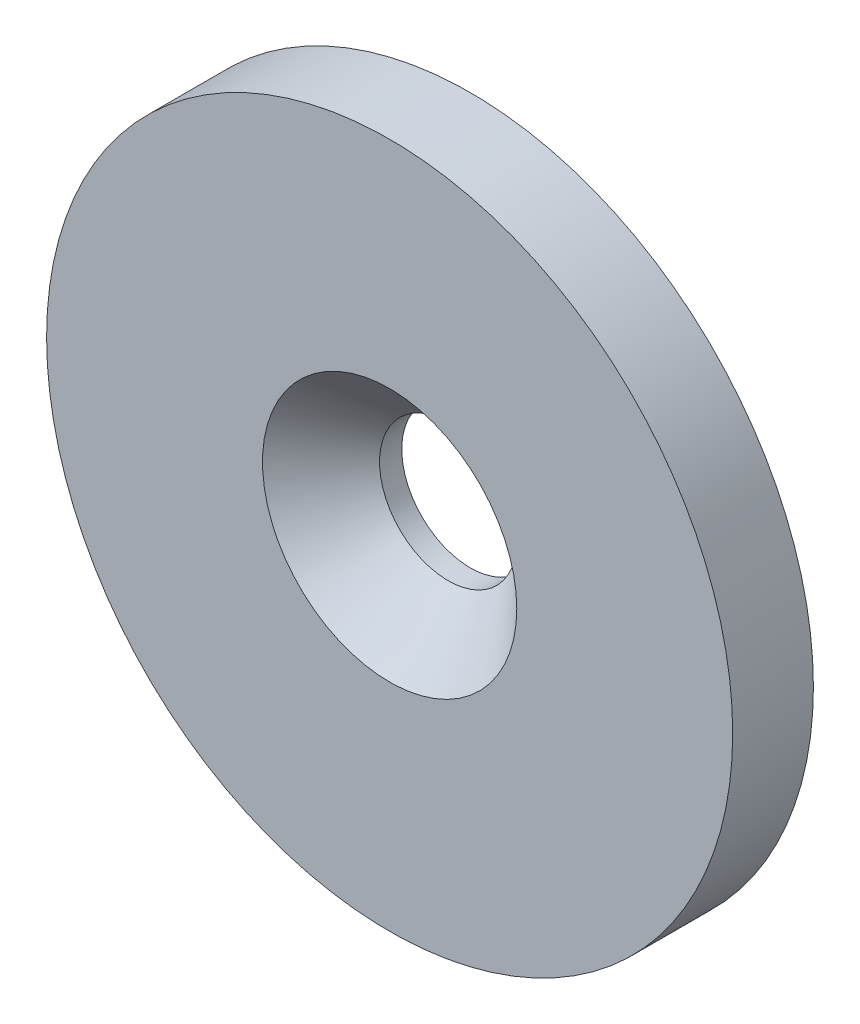
ISO-10303-21;
HEADER;
FILE_DESCRIPTION(('STEP AP214'),'2;1');
FILE_NAME('part.step','',(''),(''),'','','');
FILE_SCHEMA(('AUTOMOTIVE_DESIGN { 1 0 10303 214 1 1 1 1 }'));
ENDSEC;
DATA;
#1=APPLICATION_CONTEXT('core data for automotive mechanical design processes');
#2=APPLICATION_PROTOCOL_DEFINITION('international standard','automotive_design',2000,#1);
#3=PRODUCT_CONTEXT('',#1,'mechanical');
#4=PRODUCT('Part','Part','',(#3));
#5=PRODUCT_RELATED_PRODUCT_CATEGORY('part','',(#4));
#6=PRODUCT_DEFINITION_FORMATION('','',#4);
#7=PRODUCT_DEFINITION_CONTEXT('part definition',#1,'design');
#8=PRODUCT_DEFINITION('design','',#6,#7);
#9=PRODUCT_DEFINITION_SHAPE('','',#8);
#10=(LENGTH_UNIT() NAMED_UNIT(*) SI_UNIT(.MILLI.,.METRE.));
#11=(NAMED_UNIT(*) PLANE_ANGLE_UNIT() SI_UNIT($,.RADIAN.));
#12=(NAMED_UNIT(*) SI_UNIT($,.STERADIAN.) SOLID_ANGLE_UNIT());
#13=UNCERTAINTY_MEASURE_WITH_UNIT(LENGTH_MEASURE(1.E-05),#10,'distance_accuracy_value','');
#14=(GEOMETRIC_REPRESENTATION_CONTEXT(3) GLOBAL_UNCERTAINTY_ASSIGNED_CONTEXT((#13)) GLOBAL_UNIT_ASSIGNED_CONTEXT((#10,
#11,#12)) REPRESENTATION_CONTEXT('',''));
#15=CARTESIAN_POINT('',(0.,0.,0.));
#16=DIRECTION('',(0.,0.,1.));
#17=DIRECTION('',(1.,0.,0.));
#18=AXIS2_PLACEMENT_3D('',#15,#16,#17);
#19=CARTESIAN_POINT('',(0.,0.,-2.));
#20=DIRECTION('',(0.,0.,1.));
#21=DIRECTION('',(1.,0.,0.));
#22=AXIS2_PLACEMENT_3D('',#19,#20,#21);
#23=CYLINDRICAL_SURFACE('',#22,8.5);
#24=CARTESIAN_POINT('',(0.,0.,-2.));
#25=DIRECTION('',(0.,0.,1.));
#26=DIRECTION('',(1.,0.,0.));
#27=AXIS2_PLACEMENT_3D('',#24,#25,#26);
#28=CIRCLE('',#27,8.5);
#29=CARTESIAN_POINT('',(8.5,0.,-2.));
#30=VERTEX_POINT('',#29);
#31=EDGE_CURVE('E10',#30,#30,#28,.T.);
#32=ORIENTED_EDGE('',*,*,#31,.T.);
#33=EDGE_LOOP('',(#32));
#34=FACE_BOUND('',#33,.T.);
#35=CARTESIAN_POINT('',(0.,0.,0.));
#36=DIRECTION('',(0.,0.,1.));
#37=DIRECTION('',(1.,0.,0.));
#38=AXIS2_PLACEMENT_3D('',#35,#36,#37);
#39=CIRCLE('',#38,8.5);
#40=CARTESIAN_POINT('',(8.5,0.,0.));
#41=VERTEX_POINT('',#40);
#42=EDGE_CURVE('E38',#41,#41,#39,.T.);
#43=ORIENTED_EDGE('',*,*,#42,.F.);
#44=EDGE_LOOP('',(#43));
#45=FACE_BOUND('',#44,.T.);
#46=ADVANCED_FACE('F35',(#34,#45),#23,.T.);
#47=CARTESIAN_POINT('',(0.,0.,-2.));
#48=DIRECTION('',(0.,0.,1.));
#49=DIRECTION('',(1.,0.,0.));
#50=AXIS2_PLACEMENT_3D('',#47,#48,#49);
#51=PLANE('',#50);
#52=CARTESIAN_POINT('',(0.,0.,-2.));
#53=DIRECTION('',(0.,0.,1.));
#54=DIRECTION('',(1.,0.,0.));
#55=AXIS2_PLACEMENT_3D('',#52,#53,#54);
#56=CIRCLE('',#55,1.7);
#57=CARTESIAN_POINT('',(1.7,0.,-2.));
#58=VERTEX_POINT('',#57);
#59=EDGE_CURVE('E45',#58,#58,#56,.T.);
#60=ORIENTED_EDGE('',*,*,#59,.T.);
#61=EDGE_LOOP('',(#60));
#62=FACE_BOUND('',#61,.T.);
#63=ORIENTED_EDGE('',*,*,#31,.F.);
#64=EDGE_LOOP('',(#63));
#65=FACE_BOUND('',#64,.T.);
#66=ADVANCED_FACE('F62',(#62,#65),#51,.F.);
#67=CARTESIAN_POINT('',(0.,0.,0.));
#68=DIRECTION('',(0.,0.,1.));
#69=DIRECTION('',(1.,0.,0.));
#70=AXIS2_PLACEMENT_3D('',#67,#68,#69);
#71=PLANE('',#70);
#72=CARTESIAN_POINT('',(0.,0.,0.));
#73=DIRECTION('',(0.,0.,1.));
#74=DIRECTION('',(1.,0.,0.));
#75=AXIS2_PLACEMENT_3D('',#72,#73,#74);
#76=CIRCLE('',#75,3.15);
#77=CARTESIAN_POINT('',(3.15,0.,0.));
#78=VERTEX_POINT('',#77);
#79=EDGE_CURVE('E52',#78,#78,#76,.T.);
#80=ORIENTED_EDGE('',*,*,#79,.F.);
#81=EDGE_LOOP('',(#80));
#82=FACE_BOUND('',#81,.T.);
#83=ORIENTED_EDGE('',*,*,#42,.T.);
#84=EDGE_LOOP('',(#83));
#85=FACE_BOUND('',#84,.T.);
#86=ADVANCED_FACE('F58',(#82,#85),#71,.T.);
#87=CARTESIAN_POINT('',(0.,0.,0.));
#88=DIRECTION('',(0.,0.,1.));
#89=DIRECTION('',(1.,0.,0.));
#90=AXIS2_PLACEMENT_3D('',#87,#88,#89);
#91=CYLINDRICAL_SURFACE('',#90,1.7);
#92=ORIENTED_EDGE('',*,*,#59,.F.);
#93=EDGE_LOOP('',(#92));
#94=FACE_BOUND('',#93,.T.);
#95=CARTESIAN_POINT('',(0.,0.,-1.45));
#96=DIRECTION('',(0.,0.,1.));
#97=DIRECTION('',(1.,0.,0.));
#98=AXIS2_PLACEMENT_3D('',#95,#96,#97);
#99=CIRCLE('',#98,1.7);
#100=CARTESIAN_POINT('',(1.7,0.,-1.45));
#101=VERTEX_POINT('',#100);
#102=EDGE_CURVE('E49',#101,#101,#99,.T.);
#103=ORIENTED_EDGE('',*,*,#102,.T.);
#104=EDGE_LOOP('',(#103));
#105=FACE_BOUND('',#104,.T.);
#106=ADVANCED_FACE('F61',(#94,#105),#91,.F.);
#107=CARTESIAN_POINT('',(0.,0.,0.));
#108=DIRECTION('',(0.,0.,1.));
#109=DIRECTION('',(1.,0.,0.));
#110=AXIS2_PLACEMENT_3D('',#107,#108,#109);
#111=CONICAL_SURFACE('',#110,3.15,0.785398163397448);
#112=ORIENTED_EDGE('',*,*,#102,.F.);
#113=EDGE_LOOP('',(#112));
#114=FACE_BOUND('',#113,.T.);
#115=ORIENTED_EDGE('',*,*,#79,.T.);
#116=EDGE_LOOP('',(#115));
#117=FACE_BOUND('',#116,.T.);
#118=ADVANCED_FACE('F56',(#114,#117),#111,.F.);
#119=CLOSED_SHELL('',(#46,#66,#86,#106,#118));
#120=MANIFOLD_SOLID_BREP('B2',#119);
#121=ADVANCED_BREP_SHAPE_REPRESENTATION('',(#18,#120),#14);
#122=SHAPE_DEFINITION_REPRESENTATION(#9,#121);
ENDSEC;
END-ISO-10303-21;
